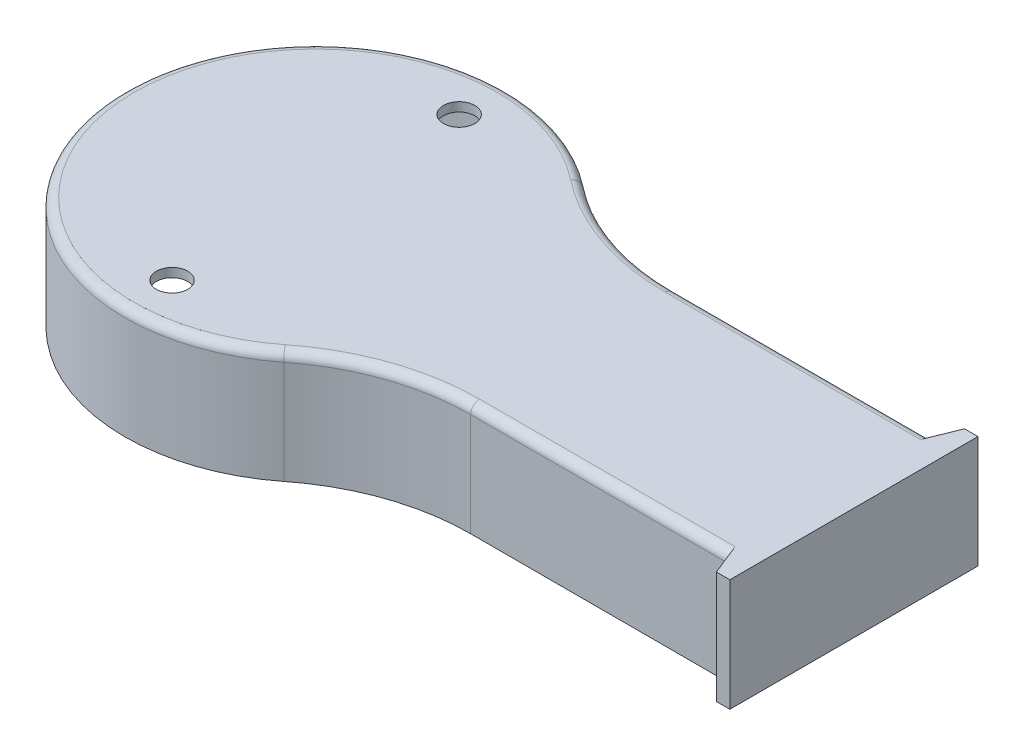
ISO-10303-21;
HEADER;
FILE_DESCRIPTION(('STEP AP214'),'2;1');
FILE_NAME('part.step','',(''),(''),'','','');
FILE_SCHEMA(('AUTOMOTIVE_DESIGN { 1 0 10303 214 1 1 1 1 }'));
ENDSEC;
DATA;
#1=APPLICATION_CONTEXT('core data for automotive mechanical design processes');
#2=APPLICATION_PROTOCOL_DEFINITION('international standard','automotive_design',2000,#1);
#3=PRODUCT_CONTEXT('',#1,'mechanical');
#4=PRODUCT('Part','Part','',(#3));
#5=PRODUCT_RELATED_PRODUCT_CATEGORY('part','',(#4));
#6=PRODUCT_DEFINITION_FORMATION('','',#4);
#7=PRODUCT_DEFINITION_CONTEXT('part definition',#1,'design');
#8=PRODUCT_DEFINITION('design','',#6,#7);
#9=PRODUCT_DEFINITION_SHAPE('','',#8);
#10=(LENGTH_UNIT() NAMED_UNIT(*) SI_UNIT(.MILLI.,.METRE.));
#11=(NAMED_UNIT(*) PLANE_ANGLE_UNIT() SI_UNIT($,.RADIAN.));
#12=(NAMED_UNIT(*) SI_UNIT($,.STERADIAN.) SOLID_ANGLE_UNIT());
#13=UNCERTAINTY_MEASURE_WITH_UNIT(LENGTH_MEASURE(1.E-05),#10,'distance_accuracy_value','');
#14=(GEOMETRIC_REPRESENTATION_CONTEXT(3) GLOBAL_UNCERTAINTY_ASSIGNED_CONTEXT((#13)) GLOBAL_UNIT_ASSIGNED_CONTEXT((#10,
#11,#12)) REPRESENTATION_CONTEXT('',''));
#15=CARTESIAN_POINT('',(0.,0.,0.));
#16=DIRECTION('',(0.,0.,1.));
#17=DIRECTION('',(1.,0.,0.));
#18=AXIS2_PLACEMENT_3D('',#15,#16,#17);
#19=CARTESIAN_POINT('',(57.2402876728534,25.,-95.3244572276667));
#20=DIRECTION('',(0.,-1.,0.));
#21=DIRECTION('',(0.,0.,-1.));
#22=AXIS2_PLACEMENT_3D('',#19,#20,#21);
#23=CYLINDRICAL_SURFACE('',#22,50.);
#24=DIRECTION('',(0.,-1.,0.));
#25=VECTOR('',#24,1.);
#26=CARTESIAN_POINT('',(26.2995916334732,25.,-56.0475768958649));
#27=LINE('',#26,#25);
#28=CARTESIAN_POINT('',(26.2995916334732,23.,-56.0475768958649));
#29=VERTEX_POINT('',#28);
#30=CARTESIAN_POINT('',(26.2995916334732,0.,-56.0475768958649));
#31=VERTEX_POINT('',#30);
#32=EDGE_CURVE('E296',#29,#31,#27,.T.);
#33=ORIENTED_EDGE('',*,*,#32,.F.);
#34=CARTESIAN_POINT('',(57.2402876728534,23.,-95.3244572276667));
#35=DIRECTION('',(0.,-1.,0.));
#36=DIRECTION('',(0.,0.,-1.));
#37=AXIS2_PLACEMENT_3D('',#34,#35,#36);
#38=CIRCLE('',#37,50.);
#39=CARTESIAN_POINT('',(57.2402876728534,23.,-45.3244572276667));
#40=VERTEX_POINT('',#39);
#41=EDGE_CURVE('E312',#29,#40,#38,.F.);
#42=ORIENTED_EDGE('',*,*,#41,.T.);
#43=DIRECTION('',(0.,-1.,0.));
#44=VECTOR('',#43,1.);
#45=CARTESIAN_POINT('',(57.2402876728534,25.,-45.3244572276667));
#46=LINE('',#45,#44);
#47=CARTESIAN_POINT('',(57.2402876728534,0.,-45.3244572276667));
#48=VERTEX_POINT('',#47);
#49=EDGE_CURVE('E279',#40,#48,#46,.T.);
#50=ORIENTED_EDGE('',*,*,#49,.T.);
#51=CARTESIAN_POINT('',(57.2402876728534,0.,-95.3244572276667));
#52=DIRECTION('',(0.,-1.,0.));
#53=DIRECTION('',(0.,0.,-1.));
#54=AXIS2_PLACEMENT_3D('',#51,#52,#53);
#55=CIRCLE('',#54,50.);
#56=EDGE_CURVE('E250',#48,#31,#55,.T.);
#57=ORIENTED_EDGE('',*,*,#56,.T.);
#58=EDGE_LOOP('',(#33,#42,#50,#57));
#59=FACE_BOUND('',#58,.T.);
#60=ADVANCED_FACE('F32',(#59),#23,.F.);
#61=CARTESIAN_POINT('',(0.,25.,-22.6622286138334));
#62=DIRECTION('',(0.,-1.,0.));
#63=DIRECTION('',(0.,0.,-1.));
#64=AXIS2_PLACEMENT_3D('',#61,#62,#63);
#65=CYLINDRICAL_SURFACE('',#64,42.5);
#66=DIRECTION('',(0.,-1.,0.));
#67=VECTOR('',#66,1.);
#68=CARTESIAN_POINT('',(26.2995916334732,25.,10.7231196681982));
#69=LINE('',#68,#67);
#70=CARTESIAN_POINT('',(26.2995916334732,23.,10.7231196681982));
#71=VERTEX_POINT('',#70);
#72=CARTESIAN_POINT('',(26.2995916334732,0.,10.7231196681982));
#73=VERTEX_POINT('',#72);
#74=EDGE_CURVE('E294',#71,#73,#69,.T.);
#75=ORIENTED_EDGE('',*,*,#74,.F.);
#76=CARTESIAN_POINT('',(0.,23.,-22.6622286138334));
#77=DIRECTION('',(0.,-1.,0.));
#78=DIRECTION('',(0.,0.,-1.));
#79=AXIS2_PLACEMENT_3D('',#76,#77,#78);
#80=CIRCLE('',#79,42.5);
#81=EDGE_CURVE('E314',#71,#29,#80,.T.);
#82=ORIENTED_EDGE('',*,*,#81,.T.);
#83=ORIENTED_EDGE('',*,*,#32,.T.);
#84=CARTESIAN_POINT('',(0.,0.,-22.6622286138334));
#85=DIRECTION('',(0.,1.,0.));
#86=DIRECTION('',(0.,0.,1.));
#87=AXIS2_PLACEMENT_3D('',#84,#85,#86);
#88=CIRCLE('',#87,42.5);
#89=EDGE_CURVE('E282',#31,#73,#88,.T.);
#90=ORIENTED_EDGE('',*,*,#89,.T.);
#91=EDGE_LOOP('',(#75,#82,#83,#90));
#92=FACE_BOUND('',#91,.T.);
#93=ADVANCED_FACE('F423',(#92),#65,.T.);
#94=CARTESIAN_POINT('',(57.2402876728534,25.,50.));
#95=DIRECTION('',(0.,-1.,0.));
#96=DIRECTION('',(0.,0.,-1.));
#97=AXIS2_PLACEMENT_3D('',#94,#95,#96);
#98=CYLINDRICAL_SURFACE('',#97,50.);
#99=DIRECTION('',(0.,-1.,0.));
#100=VECTOR('',#99,1.);
#101=CARTESIAN_POINT('',(57.2402876728534,25.,0.));
#102=LINE('',#101,#100);
#103=CARTESIAN_POINT('',(57.2402876728534,23.,0.));
#104=VERTEX_POINT('',#103);
#105=CARTESIAN_POINT('',(57.2402876728534,0.,0.));
#106=VERTEX_POINT('',#105);
#107=EDGE_CURVE('E292',#104,#106,#102,.T.);
#108=ORIENTED_EDGE('',*,*,#107,.F.);
#109=CARTESIAN_POINT('',(57.2402876728534,23.,50.));
#110=DIRECTION('',(0.,-1.,0.));
#111=DIRECTION('',(0.,0.,-1.));
#112=AXIS2_PLACEMENT_3D('',#109,#110,#111);
#113=CIRCLE('',#112,50.);
#114=EDGE_CURVE('E316',#104,#71,#113,.F.);
#115=ORIENTED_EDGE('',*,*,#114,.T.);
#116=ORIENTED_EDGE('',*,*,#74,.T.);
#117=CARTESIAN_POINT('',(57.2402876728534,0.,50.));
#118=DIRECTION('',(0.,-1.,0.));
#119=DIRECTION('',(0.,0.,1.));
#120=AXIS2_PLACEMENT_3D('',#117,#118,#119);
#121=CIRCLE('',#120,50.);
#122=EDGE_CURVE('E285',#73,#106,#121,.T.);
#123=ORIENTED_EDGE('',*,*,#122,.T.);
#124=EDGE_LOOP('',(#108,#115,#116,#123));
#125=FACE_BOUND('',#124,.T.);
#126=ADVANCED_FACE('F429',(#125),#98,.F.);
#127=CARTESIAN_POINT('',(57.2402876728534,25.,0.));
#128=DIRECTION('',(0.,0.,-1.));
#129=DIRECTION('',(-1.,0.,0.));
#130=AXIS2_PLACEMENT_3D('',#127,#128,#129);
#131=PLANE('',#130);
#132=DIRECTION('',(0.,1.,0.));
#133=VECTOR('',#132,1.);
#134=CARTESIAN_POINT('',(115.,-7.07106781186548,0.));
#135=LINE('',#134,#133);
#136=CARTESIAN_POINT('',(115.,0.,0.));
#137=VERTEX_POINT('',#136);
#138=CARTESIAN_POINT('',(115.,23.,0.));
#139=VERTEX_POINT('',#138);
#140=EDGE_CURVE('E203',#137,#139,#135,.T.);
#141=ORIENTED_EDGE('',*,*,#140,.T.);
#142=DIRECTION('',(1.,0.,0.));
#143=VECTOR('',#142,1.);
#144=CARTESIAN_POINT('',(57.2402876728534,23.,0.));
#145=LINE('',#144,#143);
#146=EDGE_CURVE('E318',#139,#104,#145,.F.);
#147=ORIENTED_EDGE('',*,*,#146,.T.);
#148=ORIENTED_EDGE('',*,*,#107,.T.);
#149=DIRECTION('',(1.,0.,0.));
#150=VECTOR('',#149,1.);
#151=CARTESIAN_POINT('',(57.2402876728534,0.,0.));
#152=LINE('',#151,#150);
#153=EDGE_CURVE('E194',#106,#137,#152,.T.);
#154=ORIENTED_EDGE('',*,*,#153,.T.);
#155=EDGE_LOOP('',(#141,#147,#148,#154));
#156=FACE_BOUND('',#155,.T.);
#157=ADVANCED_FACE('F615',(#156),#131,.F.);
#158=CARTESIAN_POINT('',(120.,25.,0.));
#159=DIRECTION('',(-1.,0.,0.));
#160=DIRECTION('',(0.,0.,1.));
#161=AXIS2_PLACEMENT_3D('',#158,#159,#160);
#162=PLANE('',#161);
#163=DIRECTION('',(0.,0.,-1.));
#164=VECTOR('',#163,1.);
#165=CARTESIAN_POINT('',(120.,0.,0.));
#166=LINE('',#165,#164);
#167=CARTESIAN_POINT('',(120.,0.,5.));
#168=VERTEX_POINT('',#167);
#169=CARTESIAN_POINT('',(120.,0.,-50.3244572276667));
#170=VERTEX_POINT('',#169);
#171=EDGE_CURVE('E180',#168,#170,#166,.T.);
#172=ORIENTED_EDGE('',*,*,#171,.T.);
#173=DIRECTION('',(0.,1.,0.));
#174=VECTOR('',#173,1.);
#175=CARTESIAN_POINT('',(120.,-7.07106781186548,-50.3244572276667));
#176=LINE('',#175,#174);
#177=CARTESIAN_POINT('',(120.,25.,-50.3244572276667));
#178=VERTEX_POINT('',#177);
#179=EDGE_CURVE('E222',#170,#178,#176,.T.);
#180=ORIENTED_EDGE('',*,*,#179,.T.);
#181=DIRECTION('',(0.,0.,-1.));
#182=VECTOR('',#181,1.);
#183=CARTESIAN_POINT('',(120.,25.,0.));
#184=LINE('',#183,#182);
#185=CARTESIAN_POINT('',(120.,25.,5.));
#186=VERTEX_POINT('',#185);
#187=EDGE_CURVE('E199',#186,#178,#184,.T.);
#188=ORIENTED_EDGE('',*,*,#187,.F.);
#189=DIRECTION('',(0.,1.,0.));
#190=VECTOR('',#189,1.);
#191=CARTESIAN_POINT('',(120.,-7.07106781186548,5.));
#192=LINE('',#191,#190);
#193=EDGE_CURVE('E197',#168,#186,#192,.T.);
#194=ORIENTED_EDGE('',*,*,#193,.F.);
#195=EDGE_LOOP('',(#172,#180,#188,#194));
#196=FACE_BOUND('',#195,.T.);
#197=ADVANCED_FACE('F198',(#196),#162,.F.);
#198=CARTESIAN_POINT('',(57.2402876728534,25.,-45.3244572276667));
#199=DIRECTION('',(0.,0.,1.));
#200=DIRECTION('',(1.,0.,0.));
#201=AXIS2_PLACEMENT_3D('',#198,#199,#200);
#202=PLANE('',#201);
#203=ORIENTED_EDGE('',*,*,#49,.F.);
#204=DIRECTION('',(-1.,0.,0.));
#205=VECTOR('',#204,1.);
#206=CARTESIAN_POINT('',(57.2402876728534,23.,-45.3244572276667));
#207=LINE('',#206,#205);
#208=CARTESIAN_POINT('',(115.,23.,-45.3244572276667));
#209=VERTEX_POINT('',#208);
#210=EDGE_CURVE('E310',#40,#209,#207,.F.);
#211=ORIENTED_EDGE('',*,*,#210,.T.);
#212=DIRECTION('',(0.,1.,0.));
#213=VECTOR('',#212,1.);
#214=CARTESIAN_POINT('',(115.,-7.07106781186548,-45.3244572276667));
#215=LINE('',#214,#213);
#216=CARTESIAN_POINT('',(115.,0.,-45.3244572276667));
#217=VERTEX_POINT('',#216);
#218=EDGE_CURVE('E228',#217,#209,#215,.T.);
#219=ORIENTED_EDGE('',*,*,#218,.F.);
#220=DIRECTION('',(-1.,0.,0.));
#221=VECTOR('',#220,1.);
#222=CARTESIAN_POINT('',(57.2402876728534,0.,-45.3244572276667));
#223=LINE('',#222,#221);
#224=EDGE_CURVE('E193',#217,#48,#223,.T.);
#225=ORIENTED_EDGE('',*,*,#224,.T.);
#226=EDGE_LOOP('',(#203,#211,#219,#225));
#227=FACE_BOUND('',#226,.T.);
#228=ADVANCED_FACE('F600',(#227),#202,.F.);
#229=CARTESIAN_POINT('',(57.2402876728534,25.,-95.3244572276667));
#230=DIRECTION('',(0.,-1.,0.));
#231=DIRECTION('',(0.,0.,-1.));
#232=AXIS2_PLACEMENT_3D('',#229,#230,#231);
#233=PLANE('',#232);
#234=CARTESIAN_POINT('',(0.,25.,9.33777138616663));
#235=DIRECTION('',(0.,1.,0.));
#236=DIRECTION('',(0.,0.,1.));
#237=AXIS2_PLACEMENT_3D('',#234,#235,#236);
#238=CIRCLE('',#237,3.5);
#239=CARTESIAN_POINT('',(0.,25.,12.8377713861666));
#240=VERTEX_POINT('',#239);
#241=EDGE_CURVE('E236',#240,#240,#238,.T.);
#242=ORIENTED_EDGE('',*,*,#241,.F.);
#243=EDGE_LOOP('',(#242));
#244=FACE_BOUND('',#243,.T.);
#245=CARTESIAN_POINT('',(0.,25.,-54.6622286138334));
#246=DIRECTION('',(0.,1.,0.));
#247=DIRECTION('',(0.,0.,1.));
#248=AXIS2_PLACEMENT_3D('',#245,#246,#247);
#249=CIRCLE('',#248,3.5);
#250=CARTESIAN_POINT('',(0.,25.,-51.1622286138334));
#251=VERTEX_POINT('',#250);
#252=EDGE_CURVE('E242',#251,#251,#249,.T.);
#253=ORIENTED_EDGE('',*,*,#252,.F.);
#254=EDGE_LOOP('',(#253));
#255=FACE_BOUND('',#254,.T.);
#256=DIRECTION('',(-0.371390676354104,0.,0.928476690885259));
#257=VECTOR('',#256,1.);
#258=CARTESIAN_POINT('',(117.,25.,-50.3244572276667));
#259=LINE('',#258,#257);
#260=CARTESIAN_POINT('',(117.,25.,-50.3244572276667));
#261=VERTEX_POINT('',#260);
#262=CARTESIAN_POINT('',(114.2,25.,-43.3244572276667));
#263=VERTEX_POINT('',#262);
#264=EDGE_CURVE('E220',#261,#263,#259,.T.);
#265=ORIENTED_EDGE('',*,*,#264,.T.);
#266=DIRECTION('',(-1.,0.,0.));
#267=VECTOR('',#266,1.);
#268=CARTESIAN_POINT('',(57.2402876728534,25.,-43.3244572276667));
#269=LINE('',#268,#267);
#270=CARTESIAN_POINT('',(57.2402876728534,25.,-43.3244572276667));
#271=VERTEX_POINT('',#270);
#272=EDGE_CURVE('E307',#263,#271,#269,.T.);
#273=ORIENTED_EDGE('',*,*,#272,.T.);
#274=CARTESIAN_POINT('',(57.2402876728534,25.,-95.3244572276667));
#275=DIRECTION('',(0.,-1.,0.));
#276=DIRECTION('',(0.,0.,-1.));
#277=AXIS2_PLACEMENT_3D('',#274,#275,#276);
#278=CIRCLE('',#277,52.);
#279=CARTESIAN_POINT('',(25.061963791898,25.,-54.4765016825929));
#280=VERTEX_POINT('',#279);
#281=EDGE_CURVE('E305',#271,#280,#278,.T.);
#282=ORIENTED_EDGE('',*,*,#281,.T.);
#283=CARTESIAN_POINT('',(0.,25.,-22.6622286138334));
#284=DIRECTION('',(0.,-1.,0.));
#285=DIRECTION('',(0.,0.,-1.));
#286=AXIS2_PLACEMENT_3D('',#283,#284,#285);
#287=CIRCLE('',#286,40.5);
#288=CARTESIAN_POINT('',(25.061963791898,25.,9.15204445492611));
#289=VERTEX_POINT('',#288);
#290=EDGE_CURVE('E303',#280,#289,#287,.F.);
#291=ORIENTED_EDGE('',*,*,#290,.T.);
#292=CARTESIAN_POINT('',(57.2402876728534,25.,50.));
#293=DIRECTION('',(0.,-1.,0.));
#294=DIRECTION('',(0.,0.,-1.));
#295=AXIS2_PLACEMENT_3D('',#292,#293,#294);
#296=CIRCLE('',#295,52.);
#297=CARTESIAN_POINT('',(57.2402876728534,25.,-2.));
#298=VERTEX_POINT('',#297);
#299=EDGE_CURVE('E301',#289,#298,#296,.T.);
#300=ORIENTED_EDGE('',*,*,#299,.T.);
#301=DIRECTION('',(1.,0.,0.));
#302=VECTOR('',#301,1.);
#303=CARTESIAN_POINT('',(57.2402876728534,25.,-2.));
#304=LINE('',#303,#302);
#305=CARTESIAN_POINT('',(114.2,25.,-2.));
#306=VERTEX_POINT('',#305);
#307=EDGE_CURVE('E298',#298,#306,#304,.T.);
#308=ORIENTED_EDGE('',*,*,#307,.T.);
#309=DIRECTION('',(0.371390676354104,0.,0.928476690885259));
#310=VECTOR('',#309,1.);
#311=CARTESIAN_POINT('',(117.,25.,5.));
#312=LINE('',#311,#310);
#313=CARTESIAN_POINT('',(117.,25.,5.));
#314=VERTEX_POINT('',#313);
#315=EDGE_CURVE('E210',#306,#314,#312,.T.);
#316=ORIENTED_EDGE('',*,*,#315,.T.);
#317=DIRECTION('',(1.,0.,0.));
#318=VECTOR('',#317,1.);
#319=CARTESIAN_POINT('',(120.,25.,5.));
#320=LINE('',#319,#318);
#321=EDGE_CURVE('E208',#314,#186,#320,.T.);
#322=ORIENTED_EDGE('',*,*,#321,.T.);
#323=ORIENTED_EDGE('',*,*,#187,.T.);
#324=DIRECTION('',(-1.,0.,0.));
#325=VECTOR('',#324,1.);
#326=CARTESIAN_POINT('',(120.,25.,-50.3244572276667));
#327=LINE('',#326,#325);
#328=EDGE_CURVE('E219',#178,#261,#327,.T.);
#329=ORIENTED_EDGE('',*,*,#328,.T.);
#330=EDGE_LOOP('',(#265,#273,#282,#291,#300,#308,#316,#322,#323,#329));
#331=FACE_BOUND('',#330,.T.);
#332=ADVANCED_FACE('F594',(#244,#255,#331),#233,.F.);
#333=CARTESIAN_POINT('',(57.2402876728534,0.,-95.3244572276667));
#334=DIRECTION('',(0.,-1.,0.));
#335=DIRECTION('',(0.,0.,-1.));
#336=AXIS2_PLACEMENT_3D('',#333,#334,#335);
#337=PLANE('',#336);
#338=DIRECTION('',(-1.,0.,0.));
#339=VECTOR('',#338,1.);
#340=CARTESIAN_POINT('',(57.2402876728534,0.,-43.3244572276667));
#341=LINE('',#340,#339);
#342=CARTESIAN_POINT('',(118.,0.,-43.3244572276667));
#343=VERTEX_POINT('',#342);
#344=CARTESIAN_POINT('',(57.2402876728534,0.,-43.3244572276667));
#345=VERTEX_POINT('',#344);
#346=EDGE_CURVE('E255',#343,#345,#341,.T.);
#347=ORIENTED_EDGE('',*,*,#346,.T.);
#348=CARTESIAN_POINT('',(57.2402876728534,0.,-95.3244572276667));
#349=DIRECTION('',(0.,-1.,0.));
#350=DIRECTION('',(0.,0.,-1.));
#351=AXIS2_PLACEMENT_3D('',#348,#349,#350);
#352=CIRCLE('',#351,52.);
#353=CARTESIAN_POINT('',(25.061963791898,0.,-54.4765016825929));
#354=VERTEX_POINT('',#353);
#355=EDGE_CURVE('E245',#345,#354,#352,.T.);
#356=ORIENTED_EDGE('',*,*,#355,.T.);
#357=CARTESIAN_POINT('',(0.,0.,-22.6622286138334));
#358=DIRECTION('',(0.,-1.,0.));
#359=DIRECTION('',(0.,0.,-1.));
#360=AXIS2_PLACEMENT_3D('',#357,#358,#359);
#361=CIRCLE('',#360,40.5);
#362=CARTESIAN_POINT('',(25.061963791898,0.,9.1520444549261));
#363=VERTEX_POINT('',#362);
#364=EDGE_CURVE('E264',#354,#363,#361,.F.);
#365=ORIENTED_EDGE('',*,*,#364,.T.);
#366=CARTESIAN_POINT('',(57.2402876728534,0.,50.));
#367=DIRECTION('',(0.,-1.,0.));
#368=DIRECTION('',(0.,0.,-1.));
#369=AXIS2_PLACEMENT_3D('',#366,#367,#368);
#370=CIRCLE('',#369,52.);
#371=CARTESIAN_POINT('',(57.2402876728534,0.,-2.));
#372=VERTEX_POINT('',#371);
#373=EDGE_CURVE('E273',#363,#372,#370,.T.);
#374=ORIENTED_EDGE('',*,*,#373,.T.);
#375=DIRECTION('',(1.,0.,0.));
#376=VECTOR('',#375,1.);
#377=CARTESIAN_POINT('',(57.2402876728534,0.,-2.));
#378=LINE('',#377,#376);
#379=CARTESIAN_POINT('',(118.,0.,-2.));
#380=VERTEX_POINT('',#379);
#381=EDGE_CURVE('E270',#372,#380,#378,.T.);
#382=ORIENTED_EDGE('',*,*,#381,.T.);
#383=DIRECTION('',(0.,0.,-1.));
#384=VECTOR('',#383,1.);
#385=CARTESIAN_POINT('',(118.,0.,-95.3244572276667));
#386=LINE('',#385,#384);
#387=EDGE_CURVE('E267',#380,#343,#386,.T.);
#388=ORIENTED_EDGE('',*,*,#387,.T.);
#389=EDGE_LOOP('',(#347,#356,#365,#374,#382,#388));
#390=FACE_BOUND('',#389,.T.);
#391=ORIENTED_EDGE('',*,*,#56,.F.);
#392=ORIENTED_EDGE('',*,*,#224,.F.);
#393=DIRECTION('',(-0.371390676354104,0.,0.928476690885259));
#394=VECTOR('',#393,1.);
#395=CARTESIAN_POINT('',(117.,0.,-50.3244572276667));
#396=LINE('',#395,#394);
#397=CARTESIAN_POINT('',(117.,0.,-50.3244572276667));
#398=VERTEX_POINT('',#397);
#399=EDGE_CURVE('E225',#398,#217,#396,.T.);
#400=ORIENTED_EDGE('',*,*,#399,.F.);
#401=DIRECTION('',(-1.,0.,0.));
#402=VECTOR('',#401,1.);
#403=CARTESIAN_POINT('',(120.,0.,-50.3244572276667));
#404=LINE('',#403,#402);
#405=EDGE_CURVE('E189',#170,#398,#404,.T.);
#406=ORIENTED_EDGE('',*,*,#405,.F.);
#407=ORIENTED_EDGE('',*,*,#171,.F.);
#408=DIRECTION('',(1.,0.,0.));
#409=VECTOR('',#408,1.);
#410=CARTESIAN_POINT('',(120.,0.,5.));
#411=LINE('',#410,#409);
#412=CARTESIAN_POINT('',(117.,0.,5.));
#413=VERTEX_POINT('',#412);
#414=EDGE_CURVE('E186',#413,#168,#411,.T.);
#415=ORIENTED_EDGE('',*,*,#414,.F.);
#416=DIRECTION('',(0.371390676354104,0.,0.928476690885259));
#417=VECTOR('',#416,1.);
#418=CARTESIAN_POINT('',(117.,0.,5.));
#419=LINE('',#418,#417);
#420=EDGE_CURVE('E214',#137,#413,#419,.T.);
#421=ORIENTED_EDGE('',*,*,#420,.F.);
#422=ORIENTED_EDGE('',*,*,#153,.F.);
#423=ORIENTED_EDGE('',*,*,#122,.F.);
#424=ORIENTED_EDGE('',*,*,#89,.F.);
#425=EDGE_LOOP('',(#391,#392,#400,#406,#407,#415,#421,#422,#423,#424));
#426=FACE_BOUND('',#425,.T.);
#427=ADVANCED_FACE('F183',(#390,#426),#337,.T.);
#428=CARTESIAN_POINT('',(57.2402876728534,25.,-95.3244572276667));
#429=DIRECTION('',(0.,-1.,0.));
#430=DIRECTION('',(0.,0.,-1.));
#431=AXIS2_PLACEMENT_3D('',#428,#429,#430);
#432=CYLINDRICAL_SURFACE('',#431,52.);
#433=DIRECTION('',(0.,-1.,0.));
#434=VECTOR('',#433,1.);
#435=CARTESIAN_POINT('',(57.2402876728534,25.,-43.3244572276667));
#436=LINE('',#435,#434);
#437=CARTESIAN_POINT('',(57.2402876728534,21.,-43.3244572276667));
#438=VERTEX_POINT('',#437);
#439=EDGE_CURVE('E252',#438,#345,#436,.T.);
#440=ORIENTED_EDGE('',*,*,#439,.F.);
#441=CARTESIAN_POINT('',(57.2402876728534,21.,-95.3244572276667));
#442=DIRECTION('',(0.,-1.,0.));
#443=DIRECTION('',(0.,0.,-1.));
#444=AXIS2_PLACEMENT_3D('',#441,#442,#443);
#445=CIRCLE('',#444,52.);
#446=CARTESIAN_POINT('',(25.061963791898,21.,-54.4765016825929));
#447=VERTEX_POINT('',#446);
#448=EDGE_CURVE('E356',#438,#447,#445,.T.);
#449=ORIENTED_EDGE('',*,*,#448,.T.);
#450=DIRECTION('',(0.,-1.,0.));
#451=VECTOR('',#450,1.);
#452=CARTESIAN_POINT('',(25.061963791898,25.,-54.4765016825929));
#453=LINE('',#452,#451);
#454=EDGE_CURVE('E248',#447,#354,#453,.T.);
#455=ORIENTED_EDGE('',*,*,#454,.T.);
#456=ORIENTED_EDGE('',*,*,#355,.F.);
#457=EDGE_LOOP('',(#440,#449,#455,#456));
#458=FACE_BOUND('',#457,.T.);
#459=ADVANCED_FACE('F410',(#458),#432,.T.);
#460=CARTESIAN_POINT('',(0.,25.,-22.6622286138334));
#461=DIRECTION('',(0.,-1.,0.));
#462=DIRECTION('',(0.,0.,-1.));
#463=AXIS2_PLACEMENT_3D('',#460,#461,#462);
#464=CYLINDRICAL_SURFACE('',#463,40.5);
#465=ORIENTED_EDGE('',*,*,#454,.F.);
#466=CARTESIAN_POINT('',(0.,21.,-22.6622286138334));
#467=DIRECTION('',(0.,-1.,0.));
#468=DIRECTION('',(0.,0.,-1.));
#469=AXIS2_PLACEMENT_3D('',#466,#467,#468);
#470=CIRCLE('',#469,40.5);
#471=CARTESIAN_POINT('',(25.061963791898,21.,9.15204445492611));
#472=VERTEX_POINT('',#471);
#473=EDGE_CURVE('E354',#447,#472,#470,.F.);
#474=ORIENTED_EDGE('',*,*,#473,.T.);
#475=DIRECTION('',(0.,-1.,0.));
#476=VECTOR('',#475,1.);
#477=CARTESIAN_POINT('',(25.061963791898,25.,9.15204445492611));
#478=LINE('',#477,#476);
#479=EDGE_CURVE('E251',#472,#363,#478,.T.);
#480=ORIENTED_EDGE('',*,*,#479,.T.);
#481=ORIENTED_EDGE('',*,*,#364,.F.);
#482=EDGE_LOOP('',(#465,#474,#480,#481));
#483=FACE_BOUND('',#482,.T.);
#484=ADVANCED_FACE('F408',(#483),#464,.F.);
#485=CARTESIAN_POINT('',(57.2402876728534,25.,50.));
#486=DIRECTION('',(0.,-1.,0.));
#487=DIRECTION('',(0.,0.,-1.));
#488=AXIS2_PLACEMENT_3D('',#485,#486,#487);
#489=CYLINDRICAL_SURFACE('',#488,52.);
#490=ORIENTED_EDGE('',*,*,#479,.F.);
#491=CARTESIAN_POINT('',(57.2402876728534,21.,50.));
#492=DIRECTION('',(0.,-1.,0.));
#493=DIRECTION('',(0.,0.,-1.));
#494=AXIS2_PLACEMENT_3D('',#491,#492,#493);
#495=CIRCLE('',#494,52.);
#496=CARTESIAN_POINT('',(57.2402876728534,21.,-2.));
#497=VERTEX_POINT('',#496);
#498=EDGE_CURVE('E352',#472,#497,#495,.T.);
#499=ORIENTED_EDGE('',*,*,#498,.T.);
#500=DIRECTION('',(0.,1.,0.));
#501=VECTOR('',#500,1.);
#502=CARTESIAN_POINT('',(57.2402876728534,25.,-2.));
#503=LINE('',#502,#501);
#504=EDGE_CURVE('E257',#497,#372,#503,.F.);
#505=ORIENTED_EDGE('',*,*,#504,.T.);
#506=ORIENTED_EDGE('',*,*,#373,.F.);
#507=EDGE_LOOP('',(#490,#499,#505,#506));
#508=FACE_BOUND('',#507,.T.);
#509=ADVANCED_FACE('F397',(#508),#489,.T.);
#510=CARTESIAN_POINT('',(57.2402876728534,25.,-2.));
#511=DIRECTION('',(0.,0.,-1.));
#512=DIRECTION('',(-1.,0.,0.));
#513=AXIS2_PLACEMENT_3D('',#510,#511,#512);
#514=PLANE('',#513);
#515=ORIENTED_EDGE('',*,*,#504,.F.);
#516=DIRECTION('',(1.,0.,0.));
#517=VECTOR('',#516,1.);
#518=CARTESIAN_POINT('',(118.,21.,-2.));
#519=LINE('',#518,#517);
#520=CARTESIAN_POINT('',(118.,21.,-2.));
#521=VERTEX_POINT('',#520);
#522=EDGE_CURVE('E325',#497,#521,#519,.T.);
#523=ORIENTED_EDGE('',*,*,#522,.T.);
#524=DIRECTION('',(0.,-1.,0.));
#525=VECTOR('',#524,1.);
#526=CARTESIAN_POINT('',(118.,25.,-2.));
#527=LINE('',#526,#525);
#528=EDGE_CURVE('E259',#521,#380,#527,.T.);
#529=ORIENTED_EDGE('',*,*,#528,.T.);
#530=ORIENTED_EDGE('',*,*,#381,.F.);
#531=EDGE_LOOP('',(#515,#523,#529,#530));
#532=FACE_BOUND('',#531,.T.);
#533=ADVANCED_FACE('F401',(#532),#514,.T.);
#534=CARTESIAN_POINT('',(118.,25.,0.));
#535=DIRECTION('',(-1.,0.,0.));
#536=DIRECTION('',(0.,0.,1.));
#537=AXIS2_PLACEMENT_3D('',#534,#535,#536);
#538=PLANE('',#537);
#539=ORIENTED_EDGE('',*,*,#528,.F.);
#540=DIRECTION('',(0.,0.,-1.));
#541=VECTOR('',#540,1.);
#542=CARTESIAN_POINT('',(118.,21.,-43.3244572276667));
#543=LINE('',#542,#541);
#544=CARTESIAN_POINT('',(118.,21.,-43.3244572276667));
#545=VERTEX_POINT('',#544);
#546=EDGE_CURVE('E41',#521,#545,#543,.T.);
#547=ORIENTED_EDGE('',*,*,#546,.T.);
#548=DIRECTION('',(0.,-1.,0.));
#549=VECTOR('',#548,1.);
#550=CARTESIAN_POINT('',(118.,25.,-43.3244572276667));
#551=LINE('',#550,#549);
#552=EDGE_CURVE('E254',#545,#343,#551,.T.);
#553=ORIENTED_EDGE('',*,*,#552,.T.);
#554=ORIENTED_EDGE('',*,*,#387,.F.);
#555=EDGE_LOOP('',(#539,#547,#553,#554));
#556=FACE_BOUND('',#555,.T.);
#557=ADVANCED_FACE('F413',(#556),#538,.T.);
#558=CARTESIAN_POINT('',(57.2402876728534,25.,-43.3244572276667));
#559=DIRECTION('',(0.,0.,1.));
#560=DIRECTION('',(1.,0.,0.));
#561=AXIS2_PLACEMENT_3D('',#558,#559,#560);
#562=PLANE('',#561);
#563=ORIENTED_EDGE('',*,*,#552,.F.);
#564=DIRECTION('',(-1.,0.,0.));
#565=VECTOR('',#564,1.);
#566=CARTESIAN_POINT('',(57.2402876728534,21.,-43.3244572276667));
#567=LINE('',#566,#565);
#568=EDGE_CURVE('E11',#545,#438,#567,.T.);
#569=ORIENTED_EDGE('',*,*,#568,.T.);
#570=ORIENTED_EDGE('',*,*,#439,.T.);
#571=ORIENTED_EDGE('',*,*,#346,.F.);
#572=EDGE_LOOP('',(#563,#569,#570,#571));
#573=FACE_BOUND('',#572,.T.);
#574=ADVANCED_FACE('F412',(#573),#562,.T.);
#575=CARTESIAN_POINT('',(57.2402876728534,23.,-95.3244572276667));
#576=DIRECTION('',(0.,-1.,0.));
#577=DIRECTION('',(0.,0.,-1.));
#578=AXIS2_PLACEMENT_3D('',#575,#576,#577);
#579=PLANE('',#578);
#580=DIRECTION('',(0.,0.,-1.));
#581=VECTOR('',#580,1.);
#582=CARTESIAN_POINT('',(116.,23.,-2.));
#583=LINE('',#582,#581);
#584=CARTESIAN_POINT('',(116.,23.,-41.3244572276667));
#585=VERTEX_POINT('',#584);
#586=CARTESIAN_POINT('',(116.,23.,-4.));
#587=VERTEX_POINT('',#586);
#588=EDGE_CURVE('E341',#585,#587,#583,.F.);
#589=ORIENTED_EDGE('',*,*,#588,.T.);
#590=DIRECTION('',(1.,0.,0.));
#591=VECTOR('',#590,1.);
#592=CARTESIAN_POINT('',(57.2402876728534,23.,-4.));
#593=LINE('',#592,#591);
#594=CARTESIAN_POINT('',(57.2402876728534,23.,-4.));
#595=VERTEX_POINT('',#594);
#596=EDGE_CURVE('E349',#587,#595,#593,.F.);
#597=ORIENTED_EDGE('',*,*,#596,.T.);
#598=CARTESIAN_POINT('',(57.2402876728534,23.,50.));
#599=DIRECTION('',(0.,-1.,0.));
#600=DIRECTION('',(0.,0.,-1.));
#601=AXIS2_PLACEMENT_3D('',#598,#599,#600);
#602=CIRCLE('',#601,54.);
#603=CARTESIAN_POINT('',(23.8243359503228,23.,7.58096924165403));
#604=VERTEX_POINT('',#603);
#605=EDGE_CURVE('E347',#595,#604,#602,.F.);
#606=ORIENTED_EDGE('',*,*,#605,.T.);
#607=CARTESIAN_POINT('',(0.,23.,-22.6622286138334));
#608=DIRECTION('',(0.,-1.,0.));
#609=DIRECTION('',(0.,0.,-1.));
#610=AXIS2_PLACEMENT_3D('',#607,#608,#609);
#611=CIRCLE('',#610,38.5);
#612=CARTESIAN_POINT('',(23.8243359503228,23.,-52.9054264693208));
#613=VERTEX_POINT('',#612);
#614=EDGE_CURVE('E345',#604,#613,#611,.T.);
#615=ORIENTED_EDGE('',*,*,#614,.T.);
#616=CARTESIAN_POINT('',(57.2402876728534,23.,-95.3244572276667));
#617=DIRECTION('',(0.,-1.,0.));
#618=DIRECTION('',(0.,0.,-1.));
#619=AXIS2_PLACEMENT_3D('',#616,#617,#618);
#620=CIRCLE('',#619,54.);
#621=CARTESIAN_POINT('',(57.2402876728534,23.,-41.3244572276667));
#622=VERTEX_POINT('',#621);
#623=EDGE_CURVE('E343',#613,#622,#620,.F.);
#624=ORIENTED_EDGE('',*,*,#623,.T.);
#625=DIRECTION('',(-1.,0.,0.));
#626=VECTOR('',#625,1.);
#627=CARTESIAN_POINT('',(118.,23.,-41.3244572276667));
#628=LINE('',#627,#626);
#629=EDGE_CURVE('E339',#622,#585,#628,.F.);
#630=ORIENTED_EDGE('',*,*,#629,.T.);
#631=EDGE_LOOP('',(#589,#597,#606,#615,#624,#630));
#632=FACE_BOUND('',#631,.T.);
#633=CARTESIAN_POINT('',(0.,23.,9.33777138616663));
#634=DIRECTION('',(0.,-1.,0.));
#635=DIRECTION('',(0.,0.,-1.));
#636=AXIS2_PLACEMENT_3D('',#633,#634,#635);
#637=CIRCLE('',#636,3.5);
#638=CARTESIAN_POINT('',(0.,23.,5.83777138616663));
#639=VERTEX_POINT('',#638);
#640=EDGE_CURVE('E233',#639,#639,#637,.F.);
#641=ORIENTED_EDGE('',*,*,#640,.T.);
#642=EDGE_LOOP('',(#641));
#643=FACE_BOUND('',#642,.T.);
#644=CARTESIAN_POINT('',(0.,23.,-54.6622286138334));
#645=DIRECTION('',(0.,-1.,0.));
#646=DIRECTION('',(0.,0.,-1.));
#647=AXIS2_PLACEMENT_3D('',#644,#645,#646);
#648=CIRCLE('',#647,3.5);
#649=CARTESIAN_POINT('',(0.,23.,-58.1622286138334));
#650=VERTEX_POINT('',#649);
#651=EDGE_CURVE('E239',#650,#650,#648,.F.);
#652=ORIENTED_EDGE('',*,*,#651,.T.);
#653=EDGE_LOOP('',(#652));
#654=FACE_BOUND('',#653,.T.);
#655=ADVANCED_FACE('F384',(#632,#643,#654),#579,.T.);
#656=CARTESIAN_POINT('',(0.,-0.001000000000001,-54.6622286138334));
#657=DIRECTION('',(0.,1.,0.));
#658=DIRECTION('',(0.,0.,1.));
#659=AXIS2_PLACEMENT_3D('',#656,#657,#658);
#660=CYLINDRICAL_SURFACE('',#659,3.5);
#661=ORIENTED_EDGE('',*,*,#651,.F.);
#662=EDGE_LOOP('',(#661));
#663=FACE_BOUND('',#662,.T.);
#664=ORIENTED_EDGE('',*,*,#252,.T.);
#665=EDGE_LOOP('',(#664));
#666=FACE_BOUND('',#665,.T.);
#667=ADVANCED_FACE('F534',(#663,#666),#660,.F.);
#668=CARTESIAN_POINT('',(0.,-0.001000000000001,9.33777138616663));
#669=DIRECTION('',(0.,1.,0.));
#670=DIRECTION('',(0.,0.,1.));
#671=AXIS2_PLACEMENT_3D('',#668,#669,#670);
#672=CYLINDRICAL_SURFACE('',#671,3.5);
#673=ORIENTED_EDGE('',*,*,#640,.F.);
#674=EDGE_LOOP('',(#673));
#675=FACE_BOUND('',#674,.T.);
#676=ORIENTED_EDGE('',*,*,#241,.T.);
#677=EDGE_LOOP('',(#676));
#678=FACE_BOUND('',#677,.T.);
#679=ADVANCED_FACE('F525',(#675,#678),#672,.F.);
#680=CARTESIAN_POINT('',(120.,-7.07106781186548,-50.3244572276667));
#681=DIRECTION('',(0.,0.,-1.));
#682=DIRECTION('',(-1.,0.,0.));
#683=AXIS2_PLACEMENT_3D('',#680,#681,#682);
#684=PLANE('',#683);
#685=ORIENTED_EDGE('',*,*,#179,.F.);
#686=ORIENTED_EDGE('',*,*,#405,.T.);
#687=DIRECTION('',(0.,1.,0.));
#688=VECTOR('',#687,1.);
#689=CARTESIAN_POINT('',(117.,-7.07106781186548,-50.3244572276667));
#690=LINE('',#689,#688);
#691=EDGE_CURVE('E229',#398,#261,#690,.T.);
#692=ORIENTED_EDGE('',*,*,#691,.T.);
#693=ORIENTED_EDGE('',*,*,#328,.F.);
#694=EDGE_LOOP('',(#685,#686,#692,#693));
#695=FACE_BOUND('',#694,.T.);
#696=ADVANCED_FACE('F517',(#695),#684,.T.);
#697=CARTESIAN_POINT('',(117.,-7.07106781186548,-50.3244572276667));
#698=DIRECTION('',(-0.928476690885259,0.,-0.371390676354104));
#699=DIRECTION('',(-0.371390676354104,0.,0.928476690885259));
#700=AXIS2_PLACEMENT_3D('',#697,#698,#699);
#701=PLANE('',#700);
#702=ORIENTED_EDGE('',*,*,#691,.F.);
#703=ORIENTED_EDGE('',*,*,#399,.T.);
#704=ORIENTED_EDGE('',*,*,#218,.T.);
#705=CARTESIAN_POINT('',(114.2,23.,-43.3244572276667));
#706=DIRECTION('',(-0.928476690885259,0.,-0.371390676354104));
#707=DIRECTION('',(-0.371390676354104,0.,0.928476690885259));
#708=AXIS2_PLACEMENT_3D('',#705,#706,#707);
#709=ELLIPSE('',#708,2.1540659228538,2.);
#710=EDGE_CURVE('E320',#209,#263,#709,.F.);
#711=ORIENTED_EDGE('',*,*,#710,.T.);
#712=ORIENTED_EDGE('',*,*,#264,.F.);
#713=EDGE_LOOP('',(#702,#703,#704,#711,#712));
#714=FACE_BOUND('',#713,.T.);
#715=ADVANCED_FACE('F510',(#714),#701,.T.);
#716=CARTESIAN_POINT('',(120.,-7.07106781186548,5.));
#717=DIRECTION('',(0.,0.,1.));
#718=DIRECTION('',(1.,0.,0.));
#719=AXIS2_PLACEMENT_3D('',#716,#717,#718);
#720=PLANE('',#719);
#721=DIRECTION('',(0.,1.,0.));
#722=VECTOR('',#721,1.);
#723=CARTESIAN_POINT('',(117.,-7.07106781186548,5.));
#724=LINE('',#723,#722);
#725=EDGE_CURVE('E207',#413,#314,#724,.T.);
#726=ORIENTED_EDGE('',*,*,#725,.F.);
#727=ORIENTED_EDGE('',*,*,#414,.T.);
#728=ORIENTED_EDGE('',*,*,#193,.T.);
#729=ORIENTED_EDGE('',*,*,#321,.F.);
#730=EDGE_LOOP('',(#726,#727,#728,#729));
#731=FACE_BOUND('',#730,.T.);
#732=ADVANCED_FACE('F206',(#731),#720,.T.);
#733=CARTESIAN_POINT('',(117.,-7.07106781186548,5.));
#734=DIRECTION('',(-0.928476690885259,0.,0.371390676354104));
#735=DIRECTION('',(0.371390676354104,0.,0.928476690885259));
#736=AXIS2_PLACEMENT_3D('',#733,#734,#735);
#737=PLANE('',#736);
#738=ORIENTED_EDGE('',*,*,#140,.F.);
#739=ORIENTED_EDGE('',*,*,#420,.T.);
#740=ORIENTED_EDGE('',*,*,#725,.T.);
#741=ORIENTED_EDGE('',*,*,#315,.F.);
#742=CARTESIAN_POINT('',(114.2,23.,-2.));
#743=DIRECTION('',(-0.928476690885259,0.,0.371390676354104));
#744=DIRECTION('',(0.371390676354104,0.,0.928476690885259));
#745=AXIS2_PLACEMENT_3D('',#742,#743,#744);
#746=ELLIPSE('',#745,2.1540659228538,2.);
#747=EDGE_CURVE('E323',#306,#139,#746,.F.);
#748=ORIENTED_EDGE('',*,*,#747,.T.);
#749=EDGE_LOOP('',(#738,#739,#740,#741,#748));
#750=FACE_BOUND('',#749,.T.);
#751=ADVANCED_FACE('F454',(#750),#737,.T.);
#752=CARTESIAN_POINT('',(57.2402876728534,23.,-2.));
#753=DIRECTION('',(1.,0.,0.));
#754=DIRECTION('',(0.,0.,-1.));
#755=AXIS2_PLACEMENT_3D('',#752,#753,#754);
#756=CYLINDRICAL_SURFACE('',#755,2.);
#757=ORIENTED_EDGE('',*,*,#747,.F.);
#758=ORIENTED_EDGE('',*,*,#307,.F.);
#759=CARTESIAN_POINT('',(57.2402876728534,23.,-2.));
#760=DIRECTION('',(-1.,0.,0.));
#761=DIRECTION('',(0.,0.,1.));
#762=AXIS2_PLACEMENT_3D('',#759,#760,#761);
#763=CIRCLE('',#762,2.);
#764=EDGE_CURVE('E334',#104,#298,#763,.T.);
#765=ORIENTED_EDGE('',*,*,#764,.F.);
#766=ORIENTED_EDGE('',*,*,#146,.F.);
#767=EDGE_LOOP('',(#757,#758,#765,#766));
#768=FACE_BOUND('',#767,.T.);
#769=ADVANCED_FACE('F450',(#768),#756,.T.);
#770=CARTESIAN_POINT('',(57.2402876728534,23.,50.));
#771=DIRECTION('',(0.,-1.,0.));
#772=DIRECTION('',(0.,0.,-1.));
#773=AXIS2_PLACEMENT_3D('',#770,#771,#772);
#774=TOROIDAL_SURFACE('',#773,52.,2.);
#775=ORIENTED_EDGE('',*,*,#764,.T.);
#776=ORIENTED_EDGE('',*,*,#299,.F.);
#777=CARTESIAN_POINT('',(25.061963791898,23.,9.15204445492611));
#778=DIRECTION('',(-0.785537606636036,0.,0.618813920787605));
#779=DIRECTION('',(0.618813920787605,0.,0.785537606636036));
#780=AXIS2_PLACEMENT_3D('',#777,#778,#779);
#781=CIRCLE('',#780,2.);
#782=EDGE_CURVE('E331',#71,#289,#781,.T.);
#783=ORIENTED_EDGE('',*,*,#782,.F.);
#784=ORIENTED_EDGE('',*,*,#114,.F.);
#785=EDGE_LOOP('',(#775,#776,#783,#784));
#786=FACE_BOUND('',#785,.T.);
#787=ADVANCED_FACE('F446',(#786),#774,.T.);
#788=CARTESIAN_POINT('',(0.,23.,-22.6622286138334));
#789=DIRECTION('',(0.,-1.,0.));
#790=DIRECTION('',(0.,0.,-1.));
#791=AXIS2_PLACEMENT_3D('',#788,#789,#790);
#792=TOROIDAL_SURFACE('',#791,40.5,2.);
#793=ORIENTED_EDGE('',*,*,#782,.T.);
#794=ORIENTED_EDGE('',*,*,#290,.F.);
#795=CARTESIAN_POINT('',(25.061963791898,23.,-54.4765016825929));
#796=DIRECTION('',(0.785537606636037,0.,0.618813920787604));
#797=DIRECTION('',(0.618813920787604,0.,-0.785537606636037));
#798=AXIS2_PLACEMENT_3D('',#795,#796,#797);
#799=CIRCLE('',#798,2.);
#800=EDGE_CURVE('E328',#29,#280,#799,.T.);
#801=ORIENTED_EDGE('',*,*,#800,.F.);
#802=ORIENTED_EDGE('',*,*,#81,.F.);
#803=EDGE_LOOP('',(#793,#794,#801,#802));
#804=FACE_BOUND('',#803,.T.);
#805=ADVANCED_FACE('F442',(#804),#792,.T.);
#806=CARTESIAN_POINT('',(57.2402876728534,23.,-95.3244572276667));
#807=DIRECTION('',(0.,-1.,0.));
#808=DIRECTION('',(0.,0.,-1.));
#809=AXIS2_PLACEMENT_3D('',#806,#807,#808);
#810=TOROIDAL_SURFACE('',#809,52.,2.);
#811=ORIENTED_EDGE('',*,*,#800,.T.);
#812=ORIENTED_EDGE('',*,*,#281,.F.);
#813=CARTESIAN_POINT('',(57.2402876728534,23.,-43.3244572276667));
#814=DIRECTION('',(1.,0.,0.));
#815=DIRECTION('',(0.,0.,-1.));
#816=AXIS2_PLACEMENT_3D('',#813,#814,#815);
#817=CIRCLE('',#816,2.);
#818=EDGE_CURVE('E326',#40,#271,#817,.T.);
#819=ORIENTED_EDGE('',*,*,#818,.F.);
#820=ORIENTED_EDGE('',*,*,#41,.F.);
#821=EDGE_LOOP('',(#811,#812,#819,#820));
#822=FACE_BOUND('',#821,.T.);
#823=ADVANCED_FACE('F438',(#822),#810,.T.);
#824=CARTESIAN_POINT('',(57.2402876728534,23.,-43.3244572276667));
#825=DIRECTION('',(-1.,0.,0.));
#826=DIRECTION('',(0.,0.,1.));
#827=AXIS2_PLACEMENT_3D('',#824,#825,#826);
#828=CYLINDRICAL_SURFACE('',#827,2.);
#829=ORIENTED_EDGE('',*,*,#710,.F.);
#830=ORIENTED_EDGE('',*,*,#210,.F.);
#831=ORIENTED_EDGE('',*,*,#818,.T.);
#832=ORIENTED_EDGE('',*,*,#272,.F.);
#833=EDGE_LOOP('',(#829,#830,#831,#832));
#834=FACE_BOUND('',#833,.T.);
#835=ADVANCED_FACE('F435',(#834),#828,.T.);
#836=CARTESIAN_POINT('',(57.2402876728534,21.,-95.3244572276667));
#837=DIRECTION('',(0.,-1.,0.));
#838=DIRECTION('',(0.,0.,-1.));
#839=AXIS2_PLACEMENT_3D('',#836,#837,#838);
#840=TOROIDAL_SURFACE('',#839,54.,2.);
#841=CARTESIAN_POINT('',(57.2402876728534,21.,-41.3244572276667));
#842=DIRECTION('',(-1.,0.,0.));
#843=DIRECTION('',(0.,0.,1.));
#844=AXIS2_PLACEMENT_3D('',#841,#842,#843);
#845=CIRCLE('',#844,2.);
#846=EDGE_CURVE('E368',#622,#438,#845,.T.);
#847=ORIENTED_EDGE('',*,*,#846,.F.);
#848=ORIENTED_EDGE('',*,*,#623,.F.);
#849=CARTESIAN_POINT('',(23.8243359503228,21.,-52.9054264693208));
#850=DIRECTION('',(0.785537606636036,0.,0.618813920787605));
#851=DIRECTION('',(0.618813920787605,0.,-0.785537606636036));
#852=AXIS2_PLACEMENT_3D('',#849,#850,#851);
#853=CIRCLE('',#852,2.);
#854=EDGE_CURVE('E36',#447,#613,#853,.T.);
#855=ORIENTED_EDGE('',*,*,#854,.F.);
#856=ORIENTED_EDGE('',*,*,#448,.F.);
#857=EDGE_LOOP('',(#847,#848,#855,#856));
#858=FACE_BOUND('',#857,.T.);
#859=ADVANCED_FACE('F34',(#858),#840,.F.);
#860=CARTESIAN_POINT('',(0.,21.,-22.6622286138334));
#861=DIRECTION('',(0.,-1.,0.));
#862=DIRECTION('',(0.,0.,-1.));
#863=AXIS2_PLACEMENT_3D('',#860,#861,#862);
#864=TOROIDAL_SURFACE('',#863,38.5,2.);
#865=ORIENTED_EDGE('',*,*,#854,.T.);
#866=ORIENTED_EDGE('',*,*,#614,.F.);
#867=CARTESIAN_POINT('',(23.8243359503228,21.,7.58096924165403));
#868=DIRECTION('',(-0.785537606636036,0.,0.618813920787605));
#869=DIRECTION('',(0.618813920787605,0.,0.785537606636036));
#870=AXIS2_PLACEMENT_3D('',#867,#868,#869);
#871=CIRCLE('',#870,2.);
#872=EDGE_CURVE('E366',#472,#604,#871,.T.);
#873=ORIENTED_EDGE('',*,*,#872,.F.);
#874=ORIENTED_EDGE('',*,*,#473,.F.);
#875=EDGE_LOOP('',(#865,#866,#873,#874));
#876=FACE_BOUND('',#875,.T.);
#877=ADVANCED_FACE('F378',(#876),#864,.F.);
#878=CARTESIAN_POINT('',(57.2402876728534,21.,-41.3244572276667));
#879=DIRECTION('',(1.,0.,0.));
#880=DIRECTION('',(0.,0.,-1.));
#881=AXIS2_PLACEMENT_3D('',#878,#879,#880);
#882=CYLINDRICAL_SURFACE('',#881,2.);
#883=ORIENTED_EDGE('',*,*,#846,.T.);
#884=ORIENTED_EDGE('',*,*,#568,.F.);
#885=CARTESIAN_POINT('',(116.,21.,-41.3244572276667));
#886=DIRECTION('',(0.707106781186547,0.,0.707106781186547));
#887=DIRECTION('',(-0.707106781186548,0.,0.707106781186547));
#888=AXIS2_PLACEMENT_3D('',#885,#886,#887);
#889=ELLIPSE('',#888,2.82842712474619,2.);
#890=EDGE_CURVE('E363',#585,#545,#889,.F.);
#891=ORIENTED_EDGE('',*,*,#890,.F.);
#892=ORIENTED_EDGE('',*,*,#629,.F.);
#893=EDGE_LOOP('',(#883,#884,#891,#892));
#894=FACE_BOUND('',#893,.T.);
#895=ADVANCED_FACE('F466',(#894),#882,.F.);
#896=CARTESIAN_POINT('',(57.2402876728534,21.,50.));
#897=DIRECTION('',(0.,-1.,0.));
#898=DIRECTION('',(0.,0.,-1.));
#899=AXIS2_PLACEMENT_3D('',#896,#897,#898);
#900=TOROIDAL_SURFACE('',#899,54.,2.);
#901=ORIENTED_EDGE('',*,*,#872,.T.);
#902=ORIENTED_EDGE('',*,*,#605,.F.);
#903=CARTESIAN_POINT('',(57.2402876728534,21.,-4.));
#904=DIRECTION('',(-1.,0.,0.));
#905=DIRECTION('',(0.,0.,1.));
#906=AXIS2_PLACEMENT_3D('',#903,#904,#905);
#907=CIRCLE('',#906,2.);
#908=EDGE_CURVE('E361',#497,#595,#907,.T.);
#909=ORIENTED_EDGE('',*,*,#908,.F.);
#910=ORIENTED_EDGE('',*,*,#498,.F.);
#911=EDGE_LOOP('',(#901,#902,#909,#910));
#912=FACE_BOUND('',#911,.T.);
#913=ADVANCED_FACE('F391',(#912),#900,.F.);
#914=CARTESIAN_POINT('',(116.,21.,0.));
#915=DIRECTION('',(0.,0.,1.));
#916=DIRECTION('',(1.,0.,0.));
#917=AXIS2_PLACEMENT_3D('',#914,#915,#916);
#918=CYLINDRICAL_SURFACE('',#917,2.);
#919=ORIENTED_EDGE('',*,*,#890,.T.);
#920=ORIENTED_EDGE('',*,*,#546,.F.);
#921=CARTESIAN_POINT('',(116.,21.,-4.));
#922=DIRECTION('',(-0.707106781186547,0.,0.707106781186547));
#923=DIRECTION('',(-0.707106781186547,0.,-0.707106781186547));
#924=AXIS2_PLACEMENT_3D('',#921,#922,#923);
#925=ELLIPSE('',#924,2.82842712474619,2.);
#926=EDGE_CURVE('E359',#587,#521,#925,.F.);
#927=ORIENTED_EDGE('',*,*,#926,.F.);
#928=ORIENTED_EDGE('',*,*,#588,.F.);
#929=EDGE_LOOP('',(#919,#920,#927,#928));
#930=FACE_BOUND('',#929,.T.);
#931=ADVANCED_FACE('F459',(#930),#918,.F.);
#932=CARTESIAN_POINT('',(57.2402876728534,21.,-4.));
#933=DIRECTION('',(-1.,0.,0.));
#934=DIRECTION('',(0.,0.,1.));
#935=AXIS2_PLACEMENT_3D('',#932,#933,#934);
#936=CYLINDRICAL_SURFACE('',#935,2.);
#937=ORIENTED_EDGE('',*,*,#908,.T.);
#938=ORIENTED_EDGE('',*,*,#596,.F.);
#939=ORIENTED_EDGE('',*,*,#926,.T.);
#940=ORIENTED_EDGE('',*,*,#522,.F.);
#941=EDGE_LOOP('',(#937,#938,#939,#940));
#942=FACE_BOUND('',#941,.T.);
#943=ADVANCED_FACE('F456',(#942),#936,.F.);
#944=CLOSED_SHELL('',(#60,#93,#126,#157,#197,#228,#332,#427,#459,#484,#509,#533,#557,#574,#655,
#667,#679,#696,#715,#732,#751,#769,#787,#805,#823,#835,#859,#877,#895,#913,#931,#943));
#945=MANIFOLD_SOLID_BREP('B2',#944);
#946=ADVANCED_BREP_SHAPE_REPRESENTATION('',(#18,#945),#14);
#947=SHAPE_DEFINITION_REPRESENTATION(#9,#946);
ENDSEC;
END-ISO-10303-21;
